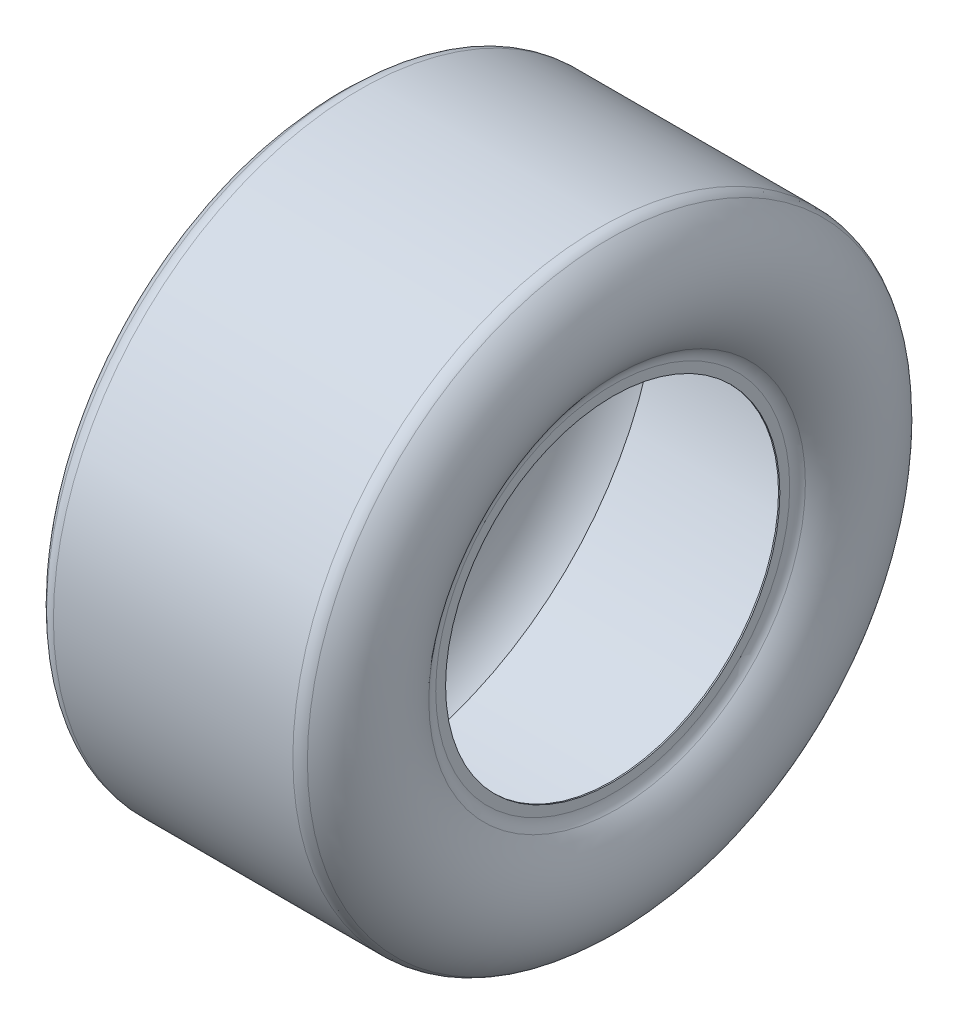
ISO-10303-21;
HEADER;
FILE_DESCRIPTION(('STEP AP214'),'2;1');
FILE_NAME('part.step','',(''),(''),'','','');
FILE_SCHEMA(('AUTOMOTIVE_DESIGN { 1 0 10303 214 1 1 1 1 }'));
ENDSEC;
DATA;
#1=APPLICATION_CONTEXT('core data for automotive mechanical design processes');
#2=APPLICATION_PROTOCOL_DEFINITION('international standard','automotive_design',2000,#1);
#3=PRODUCT_CONTEXT('',#1,'mechanical');
#4=PRODUCT('Part','Part','',(#3));
#5=PRODUCT_RELATED_PRODUCT_CATEGORY('part','',(#4));
#6=PRODUCT_DEFINITION_FORMATION('','',#4);
#7=PRODUCT_DEFINITION_CONTEXT('part definition',#1,'design');
#8=PRODUCT_DEFINITION('design','',#6,#7);
#9=PRODUCT_DEFINITION_SHAPE('','',#8);
#10=(LENGTH_UNIT() NAMED_UNIT(*) SI_UNIT(.MILLI.,.METRE.));
#11=(NAMED_UNIT(*) PLANE_ANGLE_UNIT() SI_UNIT($,.RADIAN.));
#12=(NAMED_UNIT(*) SI_UNIT($,.STERADIAN.) SOLID_ANGLE_UNIT());
#13=UNCERTAINTY_MEASURE_WITH_UNIT(LENGTH_MEASURE(1.E-05),#10,'distance_accuracy_value','');
#14=(GEOMETRIC_REPRESENTATION_CONTEXT(3) GLOBAL_UNCERTAINTY_ASSIGNED_CONTEXT((#13)) GLOBAL_UNIT_ASSIGNED_CONTEXT((#10,
#11,#12)) REPRESENTATION_CONTEXT('',''));
#15=CARTESIAN_POINT('',(0.,0.,0.));
#16=DIRECTION('',(0.,0.,1.));
#17=DIRECTION('',(1.,0.,0.));
#18=AXIS2_PLACEMENT_3D('',#15,#16,#17);
#19=CARTESIAN_POINT('',(0.,0.,0.));
#20=DIRECTION('',(1.,0.,0.));
#21=DIRECTION('',(0.,0.,-1.));
#22=AXIS2_PLACEMENT_3D('',#19,#20,#21);
#23=CYLINDRICAL_SURFACE('',#22,127.);
#24=CARTESIAN_POINT('',(-101.6,0.,0.));
#25=DIRECTION('',(1.,0.,0.));
#26=DIRECTION('',(0.,0.,-1.));
#27=AXIS2_PLACEMENT_3D('',#24,#25,#26);
#28=CIRCLE('',#27,127.);
#29=CARTESIAN_POINT('',(-101.6,0.,-127.));
#30=VERTEX_POINT('',#29);
#31=EDGE_CURVE('E81',#30,#30,#28,.T.);
#32=ORIENTED_EDGE('',*,*,#31,.F.);
#33=EDGE_LOOP('',(#32));
#34=FACE_BOUND('',#33,.T.);
#35=CARTESIAN_POINT('',(-100.584,0.,0.));
#36=DIRECTION('',(-1.,0.,0.));
#37=DIRECTION('',(0.,0.,1.));
#38=AXIS2_PLACEMENT_3D('',#35,#36,#37);
#39=CIRCLE('',#38,127.);
#40=CARTESIAN_POINT('',(-100.584,0.,127.));
#41=VERTEX_POINT('',#40);
#42=EDGE_CURVE('E96',#41,#41,#39,.F.);
#43=ORIENTED_EDGE('',*,*,#42,.T.);
#44=EDGE_LOOP('',(#43));
#45=FACE_BOUND('',#44,.T.);
#46=ADVANCED_FACE('F40',(#34,#45),#23,.F.);
#47=CARTESIAN_POINT('',(-60.8198202182321,0.,0.));
#48=DIRECTION('',(1.,0.,0.));
#49=DIRECTION('',(0.,0.,-1.));
#50=AXIS2_PLACEMENT_3D('',#47,#48,#49);
#51=TOROIDAL_SURFACE('',#50,183.479302754673,59.8301797817679);
#52=CARTESIAN_POINT('',(-104.935645943908,0.,0.));
#53=DIRECTION('',(1.,0.,0.));
#54=DIRECTION('',(0.,0.,-1.));
#55=AXIS2_PLACEMENT_3D('',#52,#53,#54);
#56=CIRCLE('',#55,143.063410666778);
#57=CARTESIAN_POINT('',(-104.935645943908,0.,-143.063410666778));
#58=VERTEX_POINT('',#57);
#59=EDGE_CURVE('E60',#58,#58,#56,.T.);
#60=ORIENTED_EDGE('',*,*,#59,.T.);
#61=EDGE_LOOP('',(#60));
#62=FACE_BOUND('',#61,.T.);
#63=CARTESIAN_POINT('',(-99.0851348779193,0.,0.));
#64=DIRECTION('',(1.,0.,0.));
#65=DIRECTION('',(0.,0.,-1.));
#66=AXIS2_PLACEMENT_3D('',#63,#64,#65);
#67=CIRCLE('',#66,229.472955650631);
#68=CARTESIAN_POINT('',(-99.0851348779193,0.,-229.472955650631));
#69=VERTEX_POINT('',#68);
#70=EDGE_CURVE('E66',#69,#69,#67,.F.);
#71=ORIENTED_EDGE('',*,*,#70,.T.);
#72=EDGE_LOOP('',(#71));
#73=FACE_BOUND('',#72,.T.);
#74=ADVANCED_FACE('F142',(#62,#73),#51,.T.);
#75=CARTESIAN_POINT('',(-101.6,0.,0.));
#76=DIRECTION('',(-1.,0.,0.));
#77=DIRECTION('',(0.,0.,1.));
#78=AXIS2_PLACEMENT_3D('',#75,#76,#77);
#79=PLANE('',#78);
#80=CARTESIAN_POINT('',(-101.6,0.,0.));
#81=DIRECTION('',(-1.,0.,0.));
#82=DIRECTION('',(0.,0.,1.));
#83=AXIS2_PLACEMENT_3D('',#80,#81,#82);
#84=CIRCLE('',#83,134.484432107989);
#85=CARTESIAN_POINT('',(-101.6,0.,134.484432107989));
#86=VERTEX_POINT('',#85);
#87=EDGE_CURVE('E54',#86,#86,#84,.T.);
#88=ORIENTED_EDGE('',*,*,#87,.T.);
#89=EDGE_LOOP('',(#88));
#90=FACE_BOUND('',#89,.T.);
#91=ORIENTED_EDGE('',*,*,#31,.T.);
#92=EDGE_LOOP('',(#91));
#93=FACE_BOUND('',#92,.T.);
#94=ADVANCED_FACE('F149',(#90,#93),#79,.T.);
#95=CARTESIAN_POINT('',(100.584,0.,0.));
#96=DIRECTION('',(1.,0.,0.));
#97=DIRECTION('',(0.,0.,-1.));
#98=AXIS2_PLACEMENT_3D('',#95,#96,#97);
#99=CIRCLE('',#98,127.);
#100=CARTESIAN_POINT('',(100.584,0.,-127.));
#101=VERTEX_POINT('',#100);
#102=EDGE_CURVE('E90',#101,#101,#99,.T.);
#103=ORIENTED_EDGE('',*,*,#102,.F.);
#104=EDGE_LOOP('',(#103));
#105=FACE_BOUND('',#104,.T.);
#106=CARTESIAN_POINT('',(101.6,0.,0.));
#107=DIRECTION('',(1.,0.,0.));
#108=DIRECTION('',(0.,0.,-1.));
#109=AXIS2_PLACEMENT_3D('',#106,#107,#108);
#110=CIRCLE('',#109,127.);
#111=CARTESIAN_POINT('',(101.6,0.,-127.));
#112=VERTEX_POINT('',#111);
#113=EDGE_CURVE('E85',#112,#112,#110,.T.);
#114=ORIENTED_EDGE('',*,*,#113,.T.);
#115=EDGE_LOOP('',(#114));
#116=FACE_BOUND('',#115,.T.);
#117=ADVANCED_FACE('F145',(#105,#116),#23,.F.);
#118=CARTESIAN_POINT('',(0.,0.,0.));
#119=DIRECTION('',(1.,0.,0.));
#120=DIRECTION('',(0.,0.,-1.));
#121=AXIS2_PLACEMENT_3D('',#118,#119,#120);
#122=CYLINDRICAL_SURFACE('',#121,232.41);
#123=CARTESIAN_POINT('',(90.9626539167955,0.,0.));
#124=DIRECTION('',(-1.,0.,0.));
#125=DIRECTION('',(0.,0.,1.));
#126=AXIS2_PLACEMENT_3D('',#123,#124,#125);
#127=CIRCLE('',#126,232.41);
#128=CARTESIAN_POINT('',(90.9626539167955,0.,232.41));
#129=VERTEX_POINT('',#128);
#130=EDGE_CURVE('E10',#129,#129,#127,.T.);
#131=ORIENTED_EDGE('',*,*,#130,.T.);
#132=EDGE_LOOP('',(#131));
#133=FACE_BOUND('',#132,.T.);
#134=CARTESIAN_POINT('',(-90.9626539167955,0.,0.));
#135=DIRECTION('',(-1.,0.,0.));
#136=DIRECTION('',(0.,0.,1.));
#137=AXIS2_PLACEMENT_3D('',#134,#135,#136);
#138=CIRCLE('',#137,232.41);
#139=CARTESIAN_POINT('',(-90.9626539167955,0.,232.41));
#140=VERTEX_POINT('',#139);
#141=EDGE_CURVE('E48',#140,#140,#138,.F.);
#142=ORIENTED_EDGE('',*,*,#141,.T.);
#143=EDGE_LOOP('',(#142));
#144=FACE_BOUND('',#143,.T.);
#145=ADVANCED_FACE('F157',(#133,#144),#122,.T.);
#146=CARTESIAN_POINT('',(60.8198202182321,0.,0.));
#147=DIRECTION('',(-1.,0.,0.));
#148=DIRECTION('',(0.,0.,-1.));
#149=AXIS2_PLACEMENT_3D('',#146,#147,#148);
#150=TOROIDAL_SURFACE('',#149,183.479302754673,59.8301797817679);
#151=CARTESIAN_POINT('',(104.935645943908,0.,0.));
#152=DIRECTION('',(-1.,0.,0.));
#153=DIRECTION('',(0.,0.,1.));
#154=AXIS2_PLACEMENT_3D('',#151,#152,#153);
#155=CIRCLE('',#154,143.063410666778);
#156=CARTESIAN_POINT('',(104.935645943908,0.,143.063410666778));
#157=VERTEX_POINT('',#156);
#158=EDGE_CURVE('E70',#157,#157,#155,.T.);
#159=ORIENTED_EDGE('',*,*,#158,.T.);
#160=EDGE_LOOP('',(#159));
#161=FACE_BOUND('',#160,.T.);
#162=CARTESIAN_POINT('',(99.0851348779193,0.,0.));
#163=DIRECTION('',(-1.,0.,0.));
#164=DIRECTION('',(0.,0.,1.));
#165=AXIS2_PLACEMENT_3D('',#162,#163,#164);
#166=CIRCLE('',#165,229.472955650631);
#167=CARTESIAN_POINT('',(99.0851348779193,0.,229.472955650631));
#168=VERTEX_POINT('',#167);
#169=EDGE_CURVE('E74',#168,#168,#166,.F.);
#170=ORIENTED_EDGE('',*,*,#169,.T.);
#171=EDGE_LOOP('',(#170));
#172=FACE_BOUND('',#171,.T.);
#173=ADVANCED_FACE('F163',(#161,#172),#150,.T.);
#174=CARTESIAN_POINT('',(101.6,0.,0.));
#175=DIRECTION('',(1.,0.,0.));
#176=DIRECTION('',(0.,0.,1.));
#177=AXIS2_PLACEMENT_3D('',#174,#175,#176);
#178=PLANE('',#177);
#179=CARTESIAN_POINT('',(101.6,0.,0.));
#180=DIRECTION('',(1.,0.,0.));
#181=DIRECTION('',(0.,0.,-1.));
#182=AXIS2_PLACEMENT_3D('',#179,#180,#181);
#183=CIRCLE('',#182,134.484432107989);
#184=CARTESIAN_POINT('',(101.6,0.,-134.484432107989));
#185=VERTEX_POINT('',#184);
#186=EDGE_CURVE('E78',#185,#185,#183,.T.);
#187=ORIENTED_EDGE('',*,*,#186,.T.);
#188=EDGE_LOOP('',(#187));
#189=FACE_BOUND('',#188,.T.);
#190=ORIENTED_EDGE('',*,*,#113,.F.);
#191=EDGE_LOOP('',(#190));
#192=FACE_BOUND('',#191,.T.);
#193=ADVANCED_FACE('F169',(#189,#192),#178,.T.);
#194=CARTESIAN_POINT('',(-60.8198202182321,0.,0.));
#195=DIRECTION('',(1.,0.,0.));
#196=DIRECTION('',(0.,0.,-1.));
#197=AXIS2_PLACEMENT_3D('',#194,#195,#196);
#198=TOROIDAL_SURFACE('',#197,183.479302754673,58.8141797817679);
#199=CARTESIAN_POINT('',(-94.9268507440754,0.,0.));
#200=DIRECTION('',(1.,0.,0.));
#201=DIRECTION('',(0.,0.,-1.));
#202=AXIS2_PLACEMENT_3D('',#199,#200,#201);
#203=CIRCLE('',#202,231.394);
#204=CARTESIAN_POINT('',(-94.9268507440754,0.,-231.394));
#205=VERTEX_POINT('',#204);
#206=EDGE_CURVE('E100',#205,#205,#203,.T.);
#207=ORIENTED_EDGE('',*,*,#206,.T.);
#208=EDGE_LOOP('',(#207));
#209=FACE_BOUND('',#208,.T.);
#210=CARTESIAN_POINT('',(-100.584,0.,0.));
#211=DIRECTION('',(1.,0.,0.));
#212=DIRECTION('',(0.,0.,-1.));
#213=AXIS2_PLACEMENT_3D('',#210,#211,#212);
#214=CIRCLE('',#213,140.144354390964);
#215=CARTESIAN_POINT('',(-100.584,0.,-140.144354390964));
#216=VERTEX_POINT('',#215);
#217=EDGE_CURVE('E89',#216,#216,#214,.T.);
#218=ORIENTED_EDGE('',*,*,#217,.F.);
#219=EDGE_LOOP('',(#218));
#220=FACE_BOUND('',#219,.T.);
#221=ADVANCED_FACE('F113',(#209,#220),#198,.F.);
#222=CARTESIAN_POINT('',(-100.584,0.,0.));
#223=DIRECTION('',(-1.,0.,0.));
#224=DIRECTION('',(0.,0.,1.));
#225=AXIS2_PLACEMENT_3D('',#222,#223,#224);
#226=PLANE('',#225);
#227=ORIENTED_EDGE('',*,*,#42,.F.);
#228=EDGE_LOOP('',(#227));
#229=FACE_BOUND('',#228,.T.);
#230=ORIENTED_EDGE('',*,*,#217,.T.);
#231=EDGE_LOOP('',(#230));
#232=FACE_BOUND('',#231,.T.);
#233=ADVANCED_FACE('F120',(#229,#232),#226,.F.);
#234=CARTESIAN_POINT('',(0.,0.,0.));
#235=DIRECTION('',(1.,0.,0.));
#236=DIRECTION('',(0.,0.,-1.));
#237=AXIS2_PLACEMENT_3D('',#234,#235,#236);
#238=CYLINDRICAL_SURFACE('',#237,231.394);
#239=ORIENTED_EDGE('',*,*,#206,.F.);
#240=EDGE_LOOP('',(#239));
#241=FACE_BOUND('',#240,.T.);
#242=CARTESIAN_POINT('',(94.9268507440754,0.,0.));
#243=DIRECTION('',(-1.,0.,0.));
#244=DIRECTION('',(0.,0.,1.));
#245=AXIS2_PLACEMENT_3D('',#242,#243,#244);
#246=CIRCLE('',#245,231.394);
#247=CARTESIAN_POINT('',(94.9268507440754,0.,231.394));
#248=VERTEX_POINT('',#247);
#249=EDGE_CURVE('E95',#248,#248,#246,.F.);
#250=ORIENTED_EDGE('',*,*,#249,.T.);
#251=EDGE_LOOP('',(#250));
#252=FACE_BOUND('',#251,.T.);
#253=ADVANCED_FACE('F116',(#241,#252),#238,.F.);
#254=CARTESIAN_POINT('',(60.8198202182321,0.,0.));
#255=DIRECTION('',(-1.,0.,0.));
#256=DIRECTION('',(0.,0.,-1.));
#257=AXIS2_PLACEMENT_3D('',#254,#255,#256);
#258=TOROIDAL_SURFACE('',#257,183.479302754673,58.8141797817679);
#259=ORIENTED_EDGE('',*,*,#249,.F.);
#260=EDGE_LOOP('',(#259));
#261=FACE_BOUND('',#260,.T.);
#262=CARTESIAN_POINT('',(100.584,0.,0.));
#263=DIRECTION('',(-1.,0.,0.));
#264=DIRECTION('',(0.,0.,1.));
#265=AXIS2_PLACEMENT_3D('',#262,#263,#264);
#266=CIRCLE('',#265,140.144354390964);
#267=CARTESIAN_POINT('',(100.584,0.,140.144354390964));
#268=VERTEX_POINT('',#267);
#269=EDGE_CURVE('E94',#268,#268,#266,.F.);
#270=ORIENTED_EDGE('',*,*,#269,.T.);
#271=EDGE_LOOP('',(#270));
#272=FACE_BOUND('',#271,.T.);
#273=ADVANCED_FACE('F119',(#261,#272),#258,.F.);
#274=CARTESIAN_POINT('',(100.584,0.,0.));
#275=DIRECTION('',(1.,0.,0.));
#276=DIRECTION('',(0.,0.,1.));
#277=AXIS2_PLACEMENT_3D('',#274,#275,#276);
#278=PLANE('',#277);
#279=ORIENTED_EDGE('',*,*,#102,.T.);
#280=EDGE_LOOP('',(#279));
#281=FACE_BOUND('',#280,.T.);
#282=ORIENTED_EDGE('',*,*,#269,.F.);
#283=EDGE_LOOP('',(#282));
#284=FACE_BOUND('',#283,.T.);
#285=ADVANCED_FACE('F126',(#281,#284),#278,.F.);
#286=CARTESIAN_POINT('',(114.3,0.,0.));
#287=DIRECTION('',(-1.,0.,0.));
#288=DIRECTION('',(0.,0.,1.));
#289=AXIS2_PLACEMENT_3D('',#286,#287,#288);
#290=TOROIDAL_SURFACE('',#289,134.484432107989,12.7);
#291=ORIENTED_EDGE('',*,*,#158,.F.);
#292=EDGE_LOOP('',(#291));
#293=FACE_BOUND('',#292,.T.);
#294=ORIENTED_EDGE('',*,*,#186,.F.);
#295=EDGE_LOOP('',(#294));
#296=FACE_BOUND('',#295,.T.);
#297=ADVANCED_FACE('F131',(#293,#296),#290,.F.);
#298=CARTESIAN_POINT('',(-114.3,0.,0.));
#299=DIRECTION('',(1.,0.,0.));
#300=DIRECTION('',(0.,0.,-1.));
#301=AXIS2_PLACEMENT_3D('',#298,#299,#300);
#302=TOROIDAL_SURFACE('',#301,134.484432107989,12.7);
#303=ORIENTED_EDGE('',*,*,#87,.F.);
#304=EDGE_LOOP('',(#303));
#305=FACE_BOUND('',#304,.T.);
#306=ORIENTED_EDGE('',*,*,#59,.F.);
#307=EDGE_LOOP('',(#306));
#308=FACE_BOUND('',#307,.T.);
#309=ADVANCED_FACE('F137',(#305,#308),#302,.F.);
#310=CARTESIAN_POINT('',(90.9626539167955,0.,0.));
#311=DIRECTION('',(-1.,0.,0.));
#312=DIRECTION('',(0.,0.,1.));
#313=AXIS2_PLACEMENT_3D('',#310,#311,#312);
#314=TOROIDAL_SURFACE('',#313,219.71,12.7);
#315=ORIENTED_EDGE('',*,*,#130,.F.);
#316=EDGE_LOOP('',(#315));
#317=FACE_BOUND('',#316,.T.);
#318=ORIENTED_EDGE('',*,*,#169,.F.);
#319=EDGE_LOOP('',(#318));
#320=FACE_BOUND('',#319,.T.);
#321=ADVANCED_FACE('F187',(#317,#320),#314,.T.);
#322=CARTESIAN_POINT('',(-90.9626539167955,0.,0.));
#323=DIRECTION('',(-1.,0.,0.));
#324=DIRECTION('',(0.,0.,1.));
#325=AXIS2_PLACEMENT_3D('',#322,#323,#324);
#326=TOROIDAL_SURFACE('',#325,219.71,12.7);
#327=ORIENTED_EDGE('',*,*,#70,.F.);
#328=EDGE_LOOP('',(#327));
#329=FACE_BOUND('',#328,.T.);
#330=ORIENTED_EDGE('',*,*,#141,.F.);
#331=EDGE_LOOP('',(#330));
#332=FACE_BOUND('',#331,.T.);
#333=ADVANCED_FACE('F42',(#329,#332),#326,.T.);
#334=CLOSED_SHELL('',(#46,#74,#94,#117,#145,#173,#193,#221,#233,#253,#273,#285,#297,#309,#321,#333));
#335=MANIFOLD_SOLID_BREP('B2',#334);
#336=ADVANCED_BREP_SHAPE_REPRESENTATION('',(#18,#335),#14);
#337=SHAPE_DEFINITION_REPRESENTATION(#9,#336);
ENDSEC;
END-ISO-10303-21;
